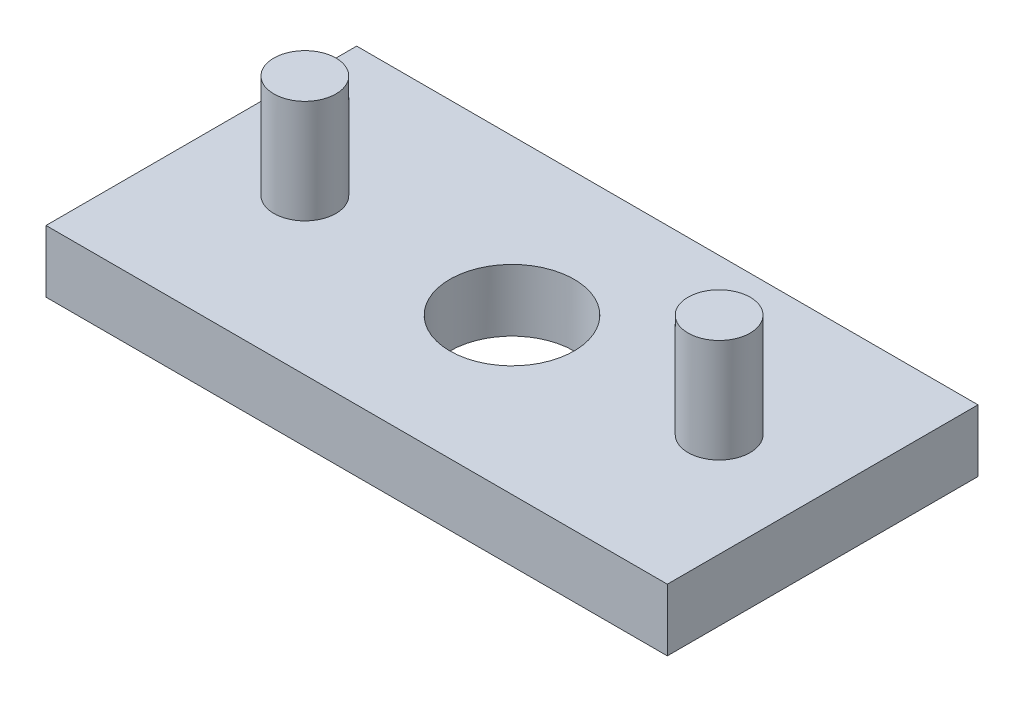
ISO-10303-21;
HEADER;
FILE_DESCRIPTION(('STEP AP214'),'2;1');
FILE_NAME('part.step','',(''),(''),'','','');
FILE_SCHEMA(('AUTOMOTIVE_DESIGN { 1 0 10303 214 1 1 1 1 }'));
ENDSEC;
DATA;
#1=APPLICATION_CONTEXT('core data for automotive mechanical design processes');
#2=APPLICATION_PROTOCOL_DEFINITION('international standard','automotive_design',2000,#1);
#3=PRODUCT_CONTEXT('',#1,'mechanical');
#4=PRODUCT('Part','Part','',(#3));
#5=PRODUCT_RELATED_PRODUCT_CATEGORY('part','',(#4));
#6=PRODUCT_DEFINITION_FORMATION('','',#4);
#7=PRODUCT_DEFINITION_CONTEXT('part definition',#1,'design');
#8=PRODUCT_DEFINITION('design','',#6,#7);
#9=PRODUCT_DEFINITION_SHAPE('','',#8);
#10=(LENGTH_UNIT() NAMED_UNIT(*) SI_UNIT(.MILLI.,.METRE.));
#11=(NAMED_UNIT(*) PLANE_ANGLE_UNIT() SI_UNIT($,.RADIAN.));
#12=(NAMED_UNIT(*) SI_UNIT($,.STERADIAN.) SOLID_ANGLE_UNIT());
#13=UNCERTAINTY_MEASURE_WITH_UNIT(LENGTH_MEASURE(1.E-05),#10,'distance_accuracy_value','');
#14=(GEOMETRIC_REPRESENTATION_CONTEXT(3) GLOBAL_UNCERTAINTY_ASSIGNED_CONTEXT((#13)) GLOBAL_UNIT_ASSIGNED_CONTEXT((#10,
#11,#12)) REPRESENTATION_CONTEXT('',''));
#15=CARTESIAN_POINT('',(0.,0.,0.));
#16=DIRECTION('',(0.,0.,1.));
#17=DIRECTION('',(1.,0.,0.));
#18=AXIS2_PLACEMENT_3D('',#15,#16,#17);
#19=CARTESIAN_POINT('',(150.,30.,75.));
#20=DIRECTION('',(-1.,0.,0.));
#21=DIRECTION('',(0.,0.,1.));
#22=AXIS2_PLACEMENT_3D('',#19,#20,#21);
#23=PLANE('',#22);
#24=DIRECTION('',(0.,0.,-1.));
#25=VECTOR('',#24,1.);
#26=CARTESIAN_POINT('',(150.,0.,75.));
#27=LINE('',#26,#25);
#28=CARTESIAN_POINT('',(150.,0.,75.));
#29=VERTEX_POINT('',#28);
#30=CARTESIAN_POINT('',(150.,0.,-75.));
#31=VERTEX_POINT('',#30);
#32=EDGE_CURVE('E106',#29,#31,#27,.T.);
#33=ORIENTED_EDGE('',*,*,#32,.T.);
#34=DIRECTION('',(0.,-1.,0.));
#35=VECTOR('',#34,1.);
#36=CARTESIAN_POINT('',(150.,30.,-75.));
#37=LINE('',#36,#35);
#38=CARTESIAN_POINT('',(150.,30.,-75.));
#39=VERTEX_POINT('',#38);
#40=EDGE_CURVE('E97',#39,#31,#37,.T.);
#41=ORIENTED_EDGE('',*,*,#40,.F.);
#42=DIRECTION('',(0.,0.,-1.));
#43=VECTOR('',#42,1.);
#44=CARTESIAN_POINT('',(150.,30.,75.));
#45=LINE('',#44,#43);
#46=CARTESIAN_POINT('',(150.,30.,75.));
#47=VERTEX_POINT('',#46);
#48=EDGE_CURVE('E91',#47,#39,#45,.T.);
#49=ORIENTED_EDGE('',*,*,#48,.F.);
#50=DIRECTION('',(0.,-1.,0.));
#51=VECTOR('',#50,1.);
#52=CARTESIAN_POINT('',(150.,30.,75.));
#53=LINE('',#52,#51);
#54=EDGE_CURVE('E102',#47,#29,#53,.T.);
#55=ORIENTED_EDGE('',*,*,#54,.T.);
#56=EDGE_LOOP('',(#33,#41,#49,#55));
#57=FACE_BOUND('',#56,.T.);
#58=ADVANCED_FACE('F38',(#57),#23,.F.);
#59=CARTESIAN_POINT('',(-150.,30.,-75.));
#60=DIRECTION('',(0.,0.,1.));
#61=DIRECTION('',(1.,0.,0.));
#62=AXIS2_PLACEMENT_3D('',#59,#60,#61);
#63=PLANE('',#62);
#64=DIRECTION('',(-1.,0.,0.));
#65=VECTOR('',#64,1.);
#66=CARTESIAN_POINT('',(-150.,0.,-75.));
#67=LINE('',#66,#65);
#68=CARTESIAN_POINT('',(-150.,0.,-75.));
#69=VERTEX_POINT('',#68);
#70=EDGE_CURVE('E96',#31,#69,#67,.T.);
#71=ORIENTED_EDGE('',*,*,#70,.T.);
#72=DIRECTION('',(0.,-1.,0.));
#73=VECTOR('',#72,1.);
#74=CARTESIAN_POINT('',(-150.,30.,-75.));
#75=LINE('',#74,#73);
#76=CARTESIAN_POINT('',(-150.,30.,-75.));
#77=VERTEX_POINT('',#76);
#78=EDGE_CURVE('E94',#77,#69,#75,.T.);
#79=ORIENTED_EDGE('',*,*,#78,.F.);
#80=DIRECTION('',(-1.,0.,0.));
#81=VECTOR('',#80,1.);
#82=CARTESIAN_POINT('',(-150.,30.,-75.));
#83=LINE('',#82,#81);
#84=EDGE_CURVE('E86',#39,#77,#83,.T.);
#85=ORIENTED_EDGE('',*,*,#84,.F.);
#86=ORIENTED_EDGE('',*,*,#40,.T.);
#87=EDGE_LOOP('',(#71,#79,#85,#86));
#88=FACE_BOUND('',#87,.T.);
#89=ADVANCED_FACE('F95',(#88),#63,.F.);
#90=CARTESIAN_POINT('',(-150.,30.,75.));
#91=DIRECTION('',(1.,0.,0.));
#92=DIRECTION('',(0.,0.,-1.));
#93=AXIS2_PLACEMENT_3D('',#90,#91,#92);
#94=PLANE('',#93);
#95=DIRECTION('',(0.,0.,1.));
#96=VECTOR('',#95,1.);
#97=CARTESIAN_POINT('',(-150.,0.,75.));
#98=LINE('',#97,#96);
#99=CARTESIAN_POINT('',(-150.,0.,75.));
#100=VERTEX_POINT('',#99);
#101=EDGE_CURVE('E72',#69,#100,#98,.T.);
#102=ORIENTED_EDGE('',*,*,#101,.T.);
#103=DIRECTION('',(0.,-1.,0.));
#104=VECTOR('',#103,1.);
#105=CARTESIAN_POINT('',(-150.,30.,75.));
#106=LINE('',#105,#104);
#107=CARTESIAN_POINT('',(-150.,30.,75.));
#108=VERTEX_POINT('',#107);
#109=EDGE_CURVE('E98',#108,#100,#106,.T.);
#110=ORIENTED_EDGE('',*,*,#109,.F.);
#111=DIRECTION('',(0.,0.,1.));
#112=VECTOR('',#111,1.);
#113=CARTESIAN_POINT('',(-150.,30.,75.));
#114=LINE('',#113,#112);
#115=EDGE_CURVE('E89',#77,#108,#114,.T.);
#116=ORIENTED_EDGE('',*,*,#115,.F.);
#117=ORIENTED_EDGE('',*,*,#78,.T.);
#118=EDGE_LOOP('',(#102,#110,#116,#117));
#119=FACE_BOUND('',#118,.T.);
#120=ADVANCED_FACE('F100',(#119),#94,.F.);
#121=CARTESIAN_POINT('',(-150.,30.,75.));
#122=DIRECTION('',(0.,0.,-1.));
#123=DIRECTION('',(-1.,0.,0.));
#124=AXIS2_PLACEMENT_3D('',#121,#122,#123);
#125=PLANE('',#124);
#126=DIRECTION('',(1.,0.,0.));
#127=VECTOR('',#126,1.);
#128=CARTESIAN_POINT('',(-150.,0.,75.));
#129=LINE('',#128,#127);
#130=EDGE_CURVE('E78',#100,#29,#129,.T.);
#131=ORIENTED_EDGE('',*,*,#130,.T.);
#132=ORIENTED_EDGE('',*,*,#54,.F.);
#133=DIRECTION('',(1.,0.,0.));
#134=VECTOR('',#133,1.);
#135=CARTESIAN_POINT('',(-150.,30.,75.));
#136=LINE('',#135,#134);
#137=EDGE_CURVE('E55',#108,#47,#136,.T.);
#138=ORIENTED_EDGE('',*,*,#137,.F.);
#139=ORIENTED_EDGE('',*,*,#109,.T.);
#140=EDGE_LOOP('',(#131,#132,#138,#139));
#141=FACE_BOUND('',#140,.T.);
#142=ADVANCED_FACE('F123',(#141),#125,.F.);
#143=CARTESIAN_POINT('',(0.,30.,0.));
#144=DIRECTION('',(0.,-1.,0.));
#145=DIRECTION('',(0.,0.,-1.));
#146=AXIS2_PLACEMENT_3D('',#143,#144,#145);
#147=PLANE('',#146);
#148=CARTESIAN_POINT('',(0.,30.,0.));
#149=DIRECTION('',(0.,1.,0.));
#150=DIRECTION('',(0.,0.,1.));
#151=AXIS2_PLACEMENT_3D('',#148,#149,#150);
#152=CIRCLE('',#151,30.);
#153=CARTESIAN_POINT('',(0.,30.,30.));
#154=VERTEX_POINT('',#153);
#155=EDGE_CURVE('E149',#154,#154,#152,.T.);
#156=ORIENTED_EDGE('',*,*,#155,.F.);
#157=EDGE_LOOP('',(#156));
#158=FACE_BOUND('',#157,.T.);
#159=CARTESIAN_POINT('',(100.,30.,0.));
#160=DIRECTION('',(0.,-1.,0.));
#161=DIRECTION('',(0.,0.,-1.));
#162=AXIS2_PLACEMENT_3D('',#159,#160,#161);
#163=CIRCLE('',#162,15.);
#164=CARTESIAN_POINT('',(100.,30.,-15.));
#165=VERTEX_POINT('',#164);
#166=EDGE_CURVE('E11',#165,#165,#163,.F.);
#167=ORIENTED_EDGE('',*,*,#166,.F.);
#168=EDGE_LOOP('',(#167));
#169=FACE_BOUND('',#168,.T.);
#170=CARTESIAN_POINT('',(-100.,30.,0.));
#171=DIRECTION('',(0.,-1.,0.));
#172=DIRECTION('',(0.,0.,-1.));
#173=AXIS2_PLACEMENT_3D('',#170,#171,#172);
#174=CIRCLE('',#173,15.);
#175=CARTESIAN_POINT('',(-100.,30.,-15.));
#176=VERTEX_POINT('',#175);
#177=EDGE_CURVE('E47',#176,#176,#174,.F.);
#178=ORIENTED_EDGE('',*,*,#177,.F.);
#179=EDGE_LOOP('',(#178));
#180=FACE_BOUND('',#179,.T.);
#181=ORIENTED_EDGE('',*,*,#48,.T.);
#182=ORIENTED_EDGE('',*,*,#84,.T.);
#183=ORIENTED_EDGE('',*,*,#115,.T.);
#184=ORIENTED_EDGE('',*,*,#137,.T.);
#185=EDGE_LOOP('',(#181,#182,#183,#184));
#186=FACE_BOUND('',#185,.T.);
#187=ADVANCED_FACE('F87',(#158,#169,#180,#186),#147,.F.);
#188=CARTESIAN_POINT('',(0.,0.,0.));
#189=DIRECTION('',(0.,-1.,0.));
#190=DIRECTION('',(0.,0.,-1.));
#191=AXIS2_PLACEMENT_3D('',#188,#189,#190);
#192=PLANE('',#191);
#193=CARTESIAN_POINT('',(0.,0.,0.));
#194=DIRECTION('',(0.,-1.,0.));
#195=DIRECTION('',(0.,0.,-1.));
#196=AXIS2_PLACEMENT_3D('',#193,#194,#195);
#197=CIRCLE('',#196,30.);
#198=CARTESIAN_POINT('',(0.,0.,-30.));
#199=VERTEX_POINT('',#198);
#200=EDGE_CURVE('E41',#199,#199,#197,.T.);
#201=ORIENTED_EDGE('',*,*,#200,.F.);
#202=EDGE_LOOP('',(#201));
#203=FACE_BOUND('',#202,.T.);
#204=ORIENTED_EDGE('',*,*,#32,.F.);
#205=ORIENTED_EDGE('',*,*,#130,.F.);
#206=ORIENTED_EDGE('',*,*,#101,.F.);
#207=ORIENTED_EDGE('',*,*,#70,.F.);
#208=EDGE_LOOP('',(#204,#205,#206,#207));
#209=FACE_BOUND('',#208,.T.);
#210=ADVANCED_FACE('F122',(#203,#209),#192,.T.);
#211=CARTESIAN_POINT('',(-100.,80.,0.));
#212=DIRECTION('',(0.,-1.,0.));
#213=DIRECTION('',(0.,0.,-1.));
#214=AXIS2_PLACEMENT_3D('',#211,#212,#213);
#215=CYLINDRICAL_SURFACE('',#214,15.);
#216=CARTESIAN_POINT('',(-100.,80.,0.));
#217=DIRECTION('',(0.,1.,0.));
#218=DIRECTION('',(0.,0.,1.));
#219=AXIS2_PLACEMENT_3D('',#216,#217,#218);
#220=CIRCLE('',#219,15.);
#221=CARTESIAN_POINT('',(-100.,80.,15.));
#222=VERTEX_POINT('',#221);
#223=EDGE_CURVE('E109',#222,#222,#220,.T.);
#224=ORIENTED_EDGE('',*,*,#223,.F.);
#225=EDGE_LOOP('',(#224));
#226=FACE_BOUND('',#225,.T.);
#227=ORIENTED_EDGE('',*,*,#177,.T.);
#228=EDGE_LOOP('',(#227));
#229=FACE_BOUND('',#228,.T.);
#230=ADVANCED_FACE('F119',(#226,#229),#215,.T.);
#231=CARTESIAN_POINT('',(-100.,80.,0.));
#232=DIRECTION('',(0.,1.,0.));
#233=DIRECTION('',(0.,0.,1.));
#234=AXIS2_PLACEMENT_3D('',#231,#232,#233);
#235=PLANE('',#234);
#236=ORIENTED_EDGE('',*,*,#223,.T.);
#237=EDGE_LOOP('',(#236));
#238=FACE_BOUND('',#237,.T.);
#239=ADVANCED_FACE('F168',(#238),#235,.T.);
#240=CARTESIAN_POINT('',(100.,80.,0.));
#241=DIRECTION('',(0.,-1.,0.));
#242=DIRECTION('',(0.,0.,-1.));
#243=AXIS2_PLACEMENT_3D('',#240,#241,#242);
#244=CYLINDRICAL_SURFACE('',#243,15.);
#245=CARTESIAN_POINT('',(100.,80.,0.));
#246=DIRECTION('',(0.,1.,0.));
#247=DIRECTION('',(0.,0.,1.));
#248=AXIS2_PLACEMENT_3D('',#245,#246,#247);
#249=CIRCLE('',#248,15.);
#250=CARTESIAN_POINT('',(100.,80.,15.));
#251=VERTEX_POINT('',#250);
#252=EDGE_CURVE('E146',#251,#251,#249,.T.);
#253=ORIENTED_EDGE('',*,*,#252,.F.);
#254=EDGE_LOOP('',(#253));
#255=FACE_BOUND('',#254,.T.);
#256=ORIENTED_EDGE('',*,*,#166,.T.);
#257=EDGE_LOOP('',(#256));
#258=FACE_BOUND('',#257,.T.);
#259=ADVANCED_FACE('F162',(#255,#258),#244,.T.);
#260=CARTESIAN_POINT('',(100.,80.,0.));
#261=DIRECTION('',(0.,1.,0.));
#262=DIRECTION('',(0.,0.,1.));
#263=AXIS2_PLACEMENT_3D('',#260,#261,#262);
#264=PLANE('',#263);
#265=ORIENTED_EDGE('',*,*,#252,.T.);
#266=EDGE_LOOP('',(#265));
#267=FACE_BOUND('',#266,.T.);
#268=ADVANCED_FACE('F157',(#267),#264,.T.);
#269=CARTESIAN_POINT('',(0.,-20.,0.));
#270=DIRECTION('',(0.,1.,0.));
#271=DIRECTION('',(0.,0.,1.));
#272=AXIS2_PLACEMENT_3D('',#269,#270,#271);
#273=CYLINDRICAL_SURFACE('',#272,30.);
#274=ORIENTED_EDGE('',*,*,#200,.T.);
#275=EDGE_LOOP('',(#274));
#276=FACE_BOUND('',#275,.T.);
#277=ORIENTED_EDGE('',*,*,#155,.T.);
#278=EDGE_LOOP('',(#277));
#279=FACE_BOUND('',#278,.T.);
#280=ADVANCED_FACE('F155',(#276,#279),#273,.F.);
#281=CLOSED_SHELL('',(#58,#89,#120,#142,#187,#210,#230,#239,#259,#268,#280));
#282=MANIFOLD_SOLID_BREP('B2',#281);
#283=ADVANCED_BREP_SHAPE_REPRESENTATION('',(#18,#282),#14);
#284=SHAPE_DEFINITION_REPRESENTATION(#9,#283);
ENDSEC;
END-ISO-10303-21;
